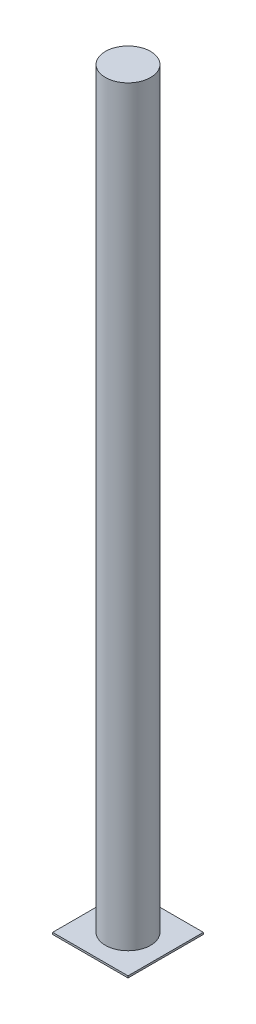
ISO-10303-21;
HEADER;
FILE_DESCRIPTION(('STEP AP214'),'2;1');
FILE_NAME('part.step','',(''),(''),'','','');
FILE_SCHEMA(('AUTOMOTIVE_DESIGN { 1 0 10303 214 1 1 1 1 }'));
ENDSEC;
DATA;
#1=APPLICATION_CONTEXT('core data for automotive mechanical design processes');
#2=APPLICATION_PROTOCOL_DEFINITION('international standard','automotive_design',2000,#1);
#3=PRODUCT_CONTEXT('',#1,'mechanical');
#4=PRODUCT('Part','Part','',(#3));
#5=PRODUCT_RELATED_PRODUCT_CATEGORY('part','',(#4));
#6=PRODUCT_DEFINITION_FORMATION('','',#4);
#7=PRODUCT_DEFINITION_CONTEXT('part definition',#1,'design');
#8=PRODUCT_DEFINITION('design','',#6,#7);
#9=PRODUCT_DEFINITION_SHAPE('','',#8);
#10=(LENGTH_UNIT() NAMED_UNIT(*) SI_UNIT(.MILLI.,.METRE.));
#11=(NAMED_UNIT(*) PLANE_ANGLE_UNIT() SI_UNIT($,.RADIAN.));
#12=(NAMED_UNIT(*) SI_UNIT($,.STERADIAN.) SOLID_ANGLE_UNIT());
#13=UNCERTAINTY_MEASURE_WITH_UNIT(LENGTH_MEASURE(1.E-05),#10,'distance_accuracy_value','');
#14=(GEOMETRIC_REPRESENTATION_CONTEXT(3) GLOBAL_UNCERTAINTY_ASSIGNED_CONTEXT((#13)) GLOBAL_UNIT_ASSIGNED_CONTEXT((#10,
#11,#12)) REPRESENTATION_CONTEXT('',''));
#15=CARTESIAN_POINT('',(0.,0.,0.));
#16=DIRECTION('',(0.,0.,1.));
#17=DIRECTION('',(1.,0.,0.));
#18=AXIS2_PLACEMENT_3D('',#15,#16,#17);
#19=CARTESIAN_POINT('',(0.,2000.,0.));
#20=DIRECTION('',(0.,-1.,0.));
#21=DIRECTION('',(0.,0.,-1.));
#22=AXIS2_PLACEMENT_3D('',#19,#20,#21);
#23=CYLINDRICAL_SURFACE('',#22,60.);
#24=CARTESIAN_POINT('',(0.,2000.,0.));
#25=DIRECTION('',(0.,1.,0.));
#26=DIRECTION('',(0.,0.,1.));
#27=AXIS2_PLACEMENT_3D('',#24,#25,#26);
#28=CIRCLE('',#27,60.);
#29=CARTESIAN_POINT('',(0.,2000.,60.));
#30=VERTEX_POINT('',#29);
#31=EDGE_CURVE('E41',#30,#30,#28,.T.);
#32=ORIENTED_EDGE('',*,*,#31,.F.);
#33=EDGE_LOOP('',(#32));
#34=FACE_BOUND('',#33,.T.);
#35=CARTESIAN_POINT('',(0.,4.99999999999989,0.));
#36=DIRECTION('',(0.,-1.,0.));
#37=DIRECTION('',(0.,0.,-1.));
#38=AXIS2_PLACEMENT_3D('',#35,#36,#37);
#39=CIRCLE('',#38,60.);
#40=CARTESIAN_POINT('',(0.,4.99999999999989,-60.));
#41=VERTEX_POINT('',#40);
#42=EDGE_CURVE('E11',#41,#41,#39,.T.);
#43=ORIENTED_EDGE('',*,*,#42,.F.);
#44=EDGE_LOOP('',(#43));
#45=FACE_BOUND('',#44,.T.);
#46=ADVANCED_FACE('F33',(#34,#45),#23,.T.);
#47=CARTESIAN_POINT('',(0.,2000.,0.));
#48=DIRECTION('',(0.,1.,0.));
#49=DIRECTION('',(0.,0.,1.));
#50=AXIS2_PLACEMENT_3D('',#47,#48,#49);
#51=PLANE('',#50);
#52=ORIENTED_EDGE('',*,*,#31,.T.);
#53=EDGE_LOOP('',(#52));
#54=FACE_BOUND('',#53,.T.);
#55=ADVANCED_FACE('F113',(#54),#51,.T.);
#56=CARTESIAN_POINT('',(100.,5.,100.));
#57=DIRECTION('',(1.,0.,0.));
#58=DIRECTION('',(0.,0.,-1.));
#59=AXIS2_PLACEMENT_3D('',#56,#57,#58);
#60=PLANE('',#59);
#61=DIRECTION('',(0.,0.,1.));
#62=VECTOR('',#61,1.);
#63=CARTESIAN_POINT('',(100.,0.,100.));
#64=LINE('',#63,#62);
#65=CARTESIAN_POINT('',(100.,0.,-100.));
#66=VERTEX_POINT('',#65);
#67=CARTESIAN_POINT('',(100.,0.,100.));
#68=VERTEX_POINT('',#67);
#69=EDGE_CURVE('E100',#66,#68,#64,.T.);
#70=ORIENTED_EDGE('',*,*,#69,.F.);
#71=DIRECTION('',(0.,-1.,0.));
#72=VECTOR('',#71,1.);
#73=CARTESIAN_POINT('',(100.,5.,-100.));
#74=LINE('',#73,#72);
#75=CARTESIAN_POINT('',(100.,5.,-100.));
#76=VERTEX_POINT('',#75);
#77=EDGE_CURVE('E49',#76,#66,#74,.T.);
#78=ORIENTED_EDGE('',*,*,#77,.F.);
#79=DIRECTION('',(0.,0.,1.));
#80=VECTOR('',#79,1.);
#81=CARTESIAN_POINT('',(100.,5.,100.));
#82=LINE('',#81,#80);
#83=CARTESIAN_POINT('',(100.,5.,100.));
#84=VERTEX_POINT('',#83);
#85=EDGE_CURVE('E94',#76,#84,#82,.T.);
#86=ORIENTED_EDGE('',*,*,#85,.T.);
#87=DIRECTION('',(0.,-1.,0.));
#88=VECTOR('',#87,1.);
#89=CARTESIAN_POINT('',(100.,5.,100.));
#90=LINE('',#89,#88);
#91=EDGE_CURVE('E77',#84,#68,#90,.T.);
#92=ORIENTED_EDGE('',*,*,#91,.T.);
#93=EDGE_LOOP('',(#70,#78,#86,#92));
#94=FACE_BOUND('',#93,.T.);
#95=ADVANCED_FACE('F132',(#94),#60,.T.);
#96=CARTESIAN_POINT('',(-100.,5.,-100.));
#97=DIRECTION('',(0.,0.,-1.));
#98=DIRECTION('',(-1.,0.,0.));
#99=AXIS2_PLACEMENT_3D('',#96,#97,#98);
#100=PLANE('',#99);
#101=DIRECTION('',(1.,0.,0.));
#102=VECTOR('',#101,1.);
#103=CARTESIAN_POINT('',(-100.,0.,-100.));
#104=LINE('',#103,#102);
#105=CARTESIAN_POINT('',(-100.,0.,-100.));
#106=VERTEX_POINT('',#105);
#107=EDGE_CURVE('E96',#106,#66,#104,.T.);
#108=ORIENTED_EDGE('',*,*,#107,.F.);
#109=DIRECTION('',(0.,-1.,0.));
#110=VECTOR('',#109,1.);
#111=CARTESIAN_POINT('',(-100.,5.,-100.));
#112=LINE('',#111,#110);
#113=CARTESIAN_POINT('',(-100.,5.,-100.));
#114=VERTEX_POINT('',#113);
#115=EDGE_CURVE('E66',#114,#106,#112,.T.);
#116=ORIENTED_EDGE('',*,*,#115,.F.);
#117=DIRECTION('',(1.,0.,0.));
#118=VECTOR('',#117,1.);
#119=CARTESIAN_POINT('',(-100.,5.,-100.));
#120=LINE('',#119,#118);
#121=EDGE_CURVE('E91',#114,#76,#120,.T.);
#122=ORIENTED_EDGE('',*,*,#121,.T.);
#123=ORIENTED_EDGE('',*,*,#77,.T.);
#124=EDGE_LOOP('',(#108,#116,#122,#123));
#125=FACE_BOUND('',#124,.T.);
#126=ADVANCED_FACE('F129',(#125),#100,.T.);
#127=CARTESIAN_POINT('',(-100.,5.,100.));
#128=DIRECTION('',(-1.,0.,0.));
#129=DIRECTION('',(0.,0.,1.));
#130=AXIS2_PLACEMENT_3D('',#127,#128,#129);
#131=PLANE('',#130);
#132=DIRECTION('',(0.,0.,-1.));
#133=VECTOR('',#132,1.);
#134=CARTESIAN_POINT('',(-100.,0.,100.));
#135=LINE('',#134,#133);
#136=CARTESIAN_POINT('',(-100.,0.,100.));
#137=VERTEX_POINT('',#136);
#138=EDGE_CURVE('E85',#137,#106,#135,.T.);
#139=ORIENTED_EDGE('',*,*,#138,.F.);
#140=DIRECTION('',(0.,-1.,0.));
#141=VECTOR('',#140,1.);
#142=CARTESIAN_POINT('',(-100.,5.,100.));
#143=LINE('',#142,#141);
#144=CARTESIAN_POINT('',(-100.,5.,100.));
#145=VERTEX_POINT('',#144);
#146=EDGE_CURVE('E80',#145,#137,#143,.T.);
#147=ORIENTED_EDGE('',*,*,#146,.F.);
#148=DIRECTION('',(0.,0.,-1.));
#149=VECTOR('',#148,1.);
#150=CARTESIAN_POINT('',(-100.,5.,100.));
#151=LINE('',#150,#149);
#152=EDGE_CURVE('E83',#145,#114,#151,.T.);
#153=ORIENTED_EDGE('',*,*,#152,.T.);
#154=ORIENTED_EDGE('',*,*,#115,.T.);
#155=EDGE_LOOP('',(#139,#147,#153,#154));
#156=FACE_BOUND('',#155,.T.);
#157=ADVANCED_FACE('F82',(#156),#131,.T.);
#158=CARTESIAN_POINT('',(-100.,5.,100.));
#159=DIRECTION('',(0.,0.,1.));
#160=DIRECTION('',(1.,0.,0.));
#161=AXIS2_PLACEMENT_3D('',#158,#159,#160);
#162=PLANE('',#161);
#163=DIRECTION('',(-1.,0.,0.));
#164=VECTOR('',#163,1.);
#165=CARTESIAN_POINT('',(-100.,0.,100.));
#166=LINE('',#165,#164);
#167=EDGE_CURVE('E103',#68,#137,#166,.T.);
#168=ORIENTED_EDGE('',*,*,#167,.F.);
#169=ORIENTED_EDGE('',*,*,#91,.F.);
#170=DIRECTION('',(-1.,0.,0.));
#171=VECTOR('',#170,1.);
#172=CARTESIAN_POINT('',(-100.,5.,100.));
#173=LINE('',#172,#171);
#174=EDGE_CURVE('E90',#84,#145,#173,.T.);
#175=ORIENTED_EDGE('',*,*,#174,.T.);
#176=ORIENTED_EDGE('',*,*,#146,.T.);
#177=EDGE_LOOP('',(#168,#169,#175,#176));
#178=FACE_BOUND('',#177,.T.);
#179=ADVANCED_FACE('F93',(#178),#162,.T.);
#180=CARTESIAN_POINT('',(0.,5.,0.));
#181=DIRECTION('',(0.,-1.,0.));
#182=DIRECTION('',(0.,0.,-1.));
#183=AXIS2_PLACEMENT_3D('',#180,#181,#182);
#184=PLANE('',#183);
#185=ORIENTED_EDGE('',*,*,#42,.T.);
#186=EDGE_LOOP('',(#185));
#187=FACE_BOUND('',#186,.T.);
#188=ORIENTED_EDGE('',*,*,#85,.F.);
#189=ORIENTED_EDGE('',*,*,#121,.F.);
#190=ORIENTED_EDGE('',*,*,#152,.F.);
#191=ORIENTED_EDGE('',*,*,#174,.F.);
#192=EDGE_LOOP('',(#188,#189,#190,#191));
#193=FACE_BOUND('',#192,.T.);
#194=ADVANCED_FACE('F89',(#187,#193),#184,.F.);
#195=CARTESIAN_POINT('',(0.,0.,0.));
#196=DIRECTION('',(0.,1.,0.));
#197=DIRECTION('',(0.,0.,1.));
#198=AXIS2_PLACEMENT_3D('',#195,#196,#197);
#199=PLANE('',#198);
#200=ORIENTED_EDGE('',*,*,#69,.T.);
#201=ORIENTED_EDGE('',*,*,#167,.T.);
#202=ORIENTED_EDGE('',*,*,#138,.T.);
#203=ORIENTED_EDGE('',*,*,#107,.T.);
#204=EDGE_LOOP('',(#200,#201,#202,#203));
#205=FACE_BOUND('',#204,.T.);
#206=ADVANCED_FACE('F120',(#205),#199,.F.);
#207=CLOSED_SHELL('',(#46,#55,#95,#126,#157,#179,#194,#206));
#208=MANIFOLD_SOLID_BREP('B2',#207);
#209=ADVANCED_BREP_SHAPE_REPRESENTATION('',(#18,#208),#14);
#210=SHAPE_DEFINITION_REPRESENTATION(#9,#209);
ENDSEC;
END-ISO-10303-21;
